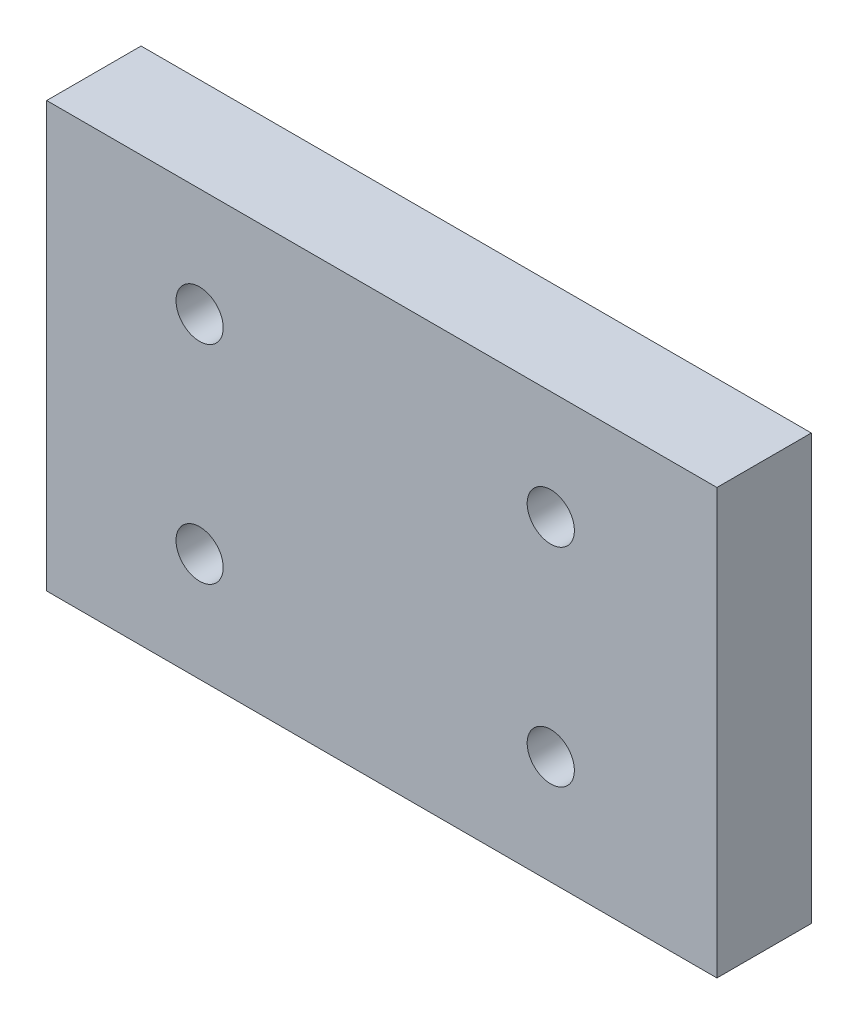
ISO-10303-21;
HEADER;
FILE_DESCRIPTION(('STEP AP214'),'2;1');
FILE_NAME('part.step','',(''),(''),'','','');
FILE_SCHEMA(('AUTOMOTIVE_DESIGN { 1 0 10303 214 1 1 1 1 }'));
ENDSEC;
DATA;
#1=APPLICATION_CONTEXT('core data for automotive mechanical design processes');
#2=APPLICATION_PROTOCOL_DEFINITION('international standard','automotive_design',2000,#1);
#3=PRODUCT_CONTEXT('',#1,'mechanical');
#4=PRODUCT('Part','Part','',(#3));
#5=PRODUCT_RELATED_PRODUCT_CATEGORY('part','',(#4));
#6=PRODUCT_DEFINITION_FORMATION('','',#4);
#7=PRODUCT_DEFINITION_CONTEXT('part definition',#1,'design');
#8=PRODUCT_DEFINITION('design','',#6,#7);
#9=PRODUCT_DEFINITION_SHAPE('','',#8);
#10=(LENGTH_UNIT() NAMED_UNIT(*) SI_UNIT(.MILLI.,.METRE.));
#11=(NAMED_UNIT(*) PLANE_ANGLE_UNIT() SI_UNIT($,.RADIAN.));
#12=(NAMED_UNIT(*) SI_UNIT($,.STERADIAN.) SOLID_ANGLE_UNIT());
#13=UNCERTAINTY_MEASURE_WITH_UNIT(LENGTH_MEASURE(1.E-05),#10,'distance_accuracy_value','');
#14=(GEOMETRIC_REPRESENTATION_CONTEXT(3) GLOBAL_UNCERTAINTY_ASSIGNED_CONTEXT((#13)) GLOBAL_UNIT_ASSIGNED_CONTEXT((#10,
#11,#12)) REPRESENTATION_CONTEXT('',''));
#15=CARTESIAN_POINT('',(0.,0.,0.));
#16=DIRECTION('',(0.,0.,1.));
#17=DIRECTION('',(1.,0.,0.));
#18=AXIS2_PLACEMENT_3D('',#15,#16,#17);
#19=CARTESIAN_POINT('',(61.,0.,10.));
#20=DIRECTION('',(1.,0.,0.));
#21=DIRECTION('',(0.,0.,-1.));
#22=AXIS2_PLACEMENT_3D('',#19,#20,#21);
#23=PLANE('',#22);
#24=DIRECTION('',(0.,-1.,0.));
#25=VECTOR('',#24,1.);
#26=CARTESIAN_POINT('',(61.,0.,0.));
#27=LINE('',#26,#25);
#28=CARTESIAN_POINT('',(61.,35.,0.));
#29=VERTEX_POINT('',#28);
#30=CARTESIAN_POINT('',(61.,-10.,0.));
#31=VERTEX_POINT('',#30);
#32=EDGE_CURVE('E121',#29,#31,#27,.T.);
#33=ORIENTED_EDGE('',*,*,#32,.F.);
#34=DIRECTION('',(0.,0.,-1.));
#35=VECTOR('',#34,1.);
#36=CARTESIAN_POINT('',(61.,35.,10.));
#37=LINE('',#36,#35);
#38=CARTESIAN_POINT('',(61.,35.,10.));
#39=VERTEX_POINT('',#38);
#40=EDGE_CURVE('E11',#39,#29,#37,.T.);
#41=ORIENTED_EDGE('',*,*,#40,.F.);
#42=DIRECTION('',(0.,-1.,0.));
#43=VECTOR('',#42,1.);
#44=CARTESIAN_POINT('',(61.,0.,10.));
#45=LINE('',#44,#43);
#46=CARTESIAN_POINT('',(61.,-10.,10.));
#47=VERTEX_POINT('',#46);
#48=EDGE_CURVE('E98',#39,#47,#45,.T.);
#49=ORIENTED_EDGE('',*,*,#48,.T.);
#50=DIRECTION('',(0.,0.,-1.));
#51=VECTOR('',#50,1.);
#52=CARTESIAN_POINT('',(61.,-10.,10.));
#53=LINE('',#52,#51);
#54=EDGE_CURVE('E59',#47,#31,#53,.T.);
#55=ORIENTED_EDGE('',*,*,#54,.T.);
#56=EDGE_LOOP('',(#33,#41,#49,#55));
#57=FACE_BOUND('',#56,.T.);
#58=ADVANCED_FACE('F41',(#57),#23,.T.);
#59=CARTESIAN_POINT('',(0.,35.,10.));
#60=DIRECTION('',(0.,-1.,0.));
#61=DIRECTION('',(0.,0.,-1.));
#62=AXIS2_PLACEMENT_3D('',#59,#60,#61);
#63=PLANE('',#62);
#64=DIRECTION('',(-1.,0.,0.));
#65=VECTOR('',#64,1.);
#66=CARTESIAN_POINT('',(0.,35.,0.));
#67=LINE('',#66,#65);
#68=CARTESIAN_POINT('',(-10.,35.,0.));
#69=VERTEX_POINT('',#68);
#70=EDGE_CURVE('E104',#29,#69,#67,.T.);
#71=ORIENTED_EDGE('',*,*,#70,.T.);
#72=DIRECTION('',(0.,0.,-1.));
#73=VECTOR('',#72,1.);
#74=CARTESIAN_POINT('',(-10.,35.,10.));
#75=LINE('',#74,#73);
#76=CARTESIAN_POINT('',(-10.,35.,10.));
#77=VERTEX_POINT('',#76);
#78=EDGE_CURVE('E51',#77,#69,#75,.T.);
#79=ORIENTED_EDGE('',*,*,#78,.F.);
#80=DIRECTION('',(-1.,0.,0.));
#81=VECTOR('',#80,1.);
#82=CARTESIAN_POINT('',(0.,35.,10.));
#83=LINE('',#82,#81);
#84=EDGE_CURVE('E94',#39,#77,#83,.T.);
#85=ORIENTED_EDGE('',*,*,#84,.F.);
#86=ORIENTED_EDGE('',*,*,#40,.T.);
#87=EDGE_LOOP('',(#71,#79,#85,#86));
#88=FACE_BOUND('',#87,.T.);
#89=ADVANCED_FACE('F102',(#88),#63,.F.);
#90=CARTESIAN_POINT('',(-10.,0.,10.));
#91=DIRECTION('',(1.,0.,0.));
#92=DIRECTION('',(0.,1.,0.));
#93=AXIS2_PLACEMENT_3D('',#90,#91,#92);
#94=PLANE('',#93);
#95=DIRECTION('',(0.,-1.,0.));
#96=VECTOR('',#95,1.);
#97=CARTESIAN_POINT('',(-10.,0.,0.));
#98=LINE('',#97,#96);
#99=CARTESIAN_POINT('',(-10.,-10.,0.));
#100=VERTEX_POINT('',#99);
#101=EDGE_CURVE('E116',#69,#100,#98,.T.);
#102=ORIENTED_EDGE('',*,*,#101,.T.);
#103=DIRECTION('',(0.,0.,-1.));
#104=VECTOR('',#103,1.);
#105=CARTESIAN_POINT('',(-10.,-10.,10.));
#106=LINE('',#105,#104);
#107=CARTESIAN_POINT('',(-10.,-10.,10.));
#108=VERTEX_POINT('',#107);
#109=EDGE_CURVE('E73',#108,#100,#106,.T.);
#110=ORIENTED_EDGE('',*,*,#109,.F.);
#111=DIRECTION('',(0.,-1.,0.));
#112=VECTOR('',#111,1.);
#113=CARTESIAN_POINT('',(-10.,0.,10.));
#114=LINE('',#113,#112);
#115=EDGE_CURVE('E85',#77,#108,#114,.T.);
#116=ORIENTED_EDGE('',*,*,#115,.F.);
#117=ORIENTED_EDGE('',*,*,#78,.T.);
#118=EDGE_LOOP('',(#102,#110,#116,#117));
#119=FACE_BOUND('',#118,.T.);
#120=ADVANCED_FACE('F87',(#119),#94,.F.);
#121=CARTESIAN_POINT('',(6.2,1.5,10.));
#122=DIRECTION('',(0.,0.,-1.));
#123=DIRECTION('',(-1.,0.,0.));
#124=AXIS2_PLACEMENT_3D('',#121,#122,#123);
#125=CYLINDRICAL_SURFACE('',#124,2.5);
#126=CARTESIAN_POINT('',(6.2,1.5,10.));
#127=DIRECTION('',(0.,0.,1.));
#128=DIRECTION('',(1.,0.,0.));
#129=AXIS2_PLACEMENT_3D('',#126,#127,#128);
#130=CIRCLE('',#129,2.5);
#131=CARTESIAN_POINT('',(8.7,1.5,10.));
#132=VERTEX_POINT('',#131);
#133=EDGE_CURVE('E144',#132,#132,#130,.T.);
#134=ORIENTED_EDGE('',*,*,#133,.T.);
#135=EDGE_LOOP('',(#134));
#136=FACE_BOUND('',#135,.T.);
#137=CARTESIAN_POINT('',(6.2,1.5,0.));
#138=DIRECTION('',(0.,0.,1.));
#139=DIRECTION('',(1.,0.,0.));
#140=AXIS2_PLACEMENT_3D('',#137,#138,#139);
#141=CIRCLE('',#140,2.5);
#142=CARTESIAN_POINT('',(8.7,1.5,0.));
#143=VERTEX_POINT('',#142);
#144=EDGE_CURVE('E124',#143,#143,#141,.T.);
#145=ORIENTED_EDGE('',*,*,#144,.F.);
#146=EDGE_LOOP('',(#145));
#147=FACE_BOUND('',#146,.T.);
#148=ADVANCED_FACE('F173',(#136,#147),#125,.F.);
#149=CARTESIAN_POINT('',(43.4,1.5,10.));
#150=DIRECTION('',(0.,0.,-1.));
#151=DIRECTION('',(-1.,0.,0.));
#152=AXIS2_PLACEMENT_3D('',#149,#150,#151);
#153=CYLINDRICAL_SURFACE('',#152,2.5);
#154=CARTESIAN_POINT('',(43.4,1.5,10.));
#155=DIRECTION('',(0.,0.,1.));
#156=DIRECTION('',(1.,0.,0.));
#157=AXIS2_PLACEMENT_3D('',#154,#155,#156);
#158=CIRCLE('',#157,2.5);
#159=CARTESIAN_POINT('',(45.9,1.5,10.));
#160=VERTEX_POINT('',#159);
#161=EDGE_CURVE('E148',#160,#160,#158,.T.);
#162=ORIENTED_EDGE('',*,*,#161,.T.);
#163=EDGE_LOOP('',(#162));
#164=FACE_BOUND('',#163,.T.);
#165=CARTESIAN_POINT('',(43.4,1.5,0.));
#166=DIRECTION('',(0.,0.,1.));
#167=DIRECTION('',(1.,0.,0.));
#168=AXIS2_PLACEMENT_3D('',#165,#166,#167);
#169=CIRCLE('',#168,2.5);
#170=CARTESIAN_POINT('',(45.9,1.5,0.));
#171=VERTEX_POINT('',#170);
#172=EDGE_CURVE('E128',#171,#171,#169,.T.);
#173=ORIENTED_EDGE('',*,*,#172,.F.);
#174=EDGE_LOOP('',(#173));
#175=FACE_BOUND('',#174,.T.);
#176=ADVANCED_FACE('F176',(#164,#175),#153,.F.);
#177=CARTESIAN_POINT('',(43.4,23.5,10.));
#178=DIRECTION('',(0.,0.,-1.));
#179=DIRECTION('',(-1.,0.,0.));
#180=AXIS2_PLACEMENT_3D('',#177,#178,#179);
#181=CYLINDRICAL_SURFACE('',#180,2.5);
#182=CARTESIAN_POINT('',(43.4,23.5,10.));
#183=DIRECTION('',(0.,0.,1.));
#184=DIRECTION('',(1.,0.,0.));
#185=AXIS2_PLACEMENT_3D('',#182,#183,#184);
#186=CIRCLE('',#185,2.5);
#187=CARTESIAN_POINT('',(45.9,23.5,10.));
#188=VERTEX_POINT('',#187);
#189=EDGE_CURVE('E152',#188,#188,#186,.T.);
#190=ORIENTED_EDGE('',*,*,#189,.T.);
#191=EDGE_LOOP('',(#190));
#192=FACE_BOUND('',#191,.T.);
#193=CARTESIAN_POINT('',(43.4,23.5,0.));
#194=DIRECTION('',(0.,0.,1.));
#195=DIRECTION('',(1.,0.,0.));
#196=AXIS2_PLACEMENT_3D('',#193,#194,#195);
#197=CIRCLE('',#196,2.5);
#198=CARTESIAN_POINT('',(45.9,23.5,0.));
#199=VERTEX_POINT('',#198);
#200=EDGE_CURVE('E132',#199,#199,#197,.T.);
#201=ORIENTED_EDGE('',*,*,#200,.F.);
#202=EDGE_LOOP('',(#201));
#203=FACE_BOUND('',#202,.T.);
#204=ADVANCED_FACE('F189',(#192,#203),#181,.F.);
#205=CARTESIAN_POINT('',(6.2,23.5,10.));
#206=DIRECTION('',(0.,0.,-1.));
#207=DIRECTION('',(-1.,0.,0.));
#208=AXIS2_PLACEMENT_3D('',#205,#206,#207);
#209=CYLINDRICAL_SURFACE('',#208,2.5);
#210=CARTESIAN_POINT('',(6.2,23.5,10.));
#211=DIRECTION('',(0.,0.,1.));
#212=DIRECTION('',(1.,0.,0.));
#213=AXIS2_PLACEMENT_3D('',#210,#211,#212);
#214=CIRCLE('',#213,2.5);
#215=CARTESIAN_POINT('',(8.7,23.5,10.));
#216=VERTEX_POINT('',#215);
#217=EDGE_CURVE('E115',#216,#216,#214,.T.);
#218=ORIENTED_EDGE('',*,*,#217,.T.);
#219=EDGE_LOOP('',(#218));
#220=FACE_BOUND('',#219,.T.);
#221=CARTESIAN_POINT('',(6.2,23.5,0.));
#222=DIRECTION('',(0.,0.,1.));
#223=DIRECTION('',(1.,0.,0.));
#224=AXIS2_PLACEMENT_3D('',#221,#222,#223);
#225=CIRCLE('',#224,2.5);
#226=CARTESIAN_POINT('',(8.7,23.5,0.));
#227=VERTEX_POINT('',#226);
#228=EDGE_CURVE('E136',#227,#227,#225,.T.);
#229=ORIENTED_EDGE('',*,*,#228,.F.);
#230=EDGE_LOOP('',(#229));
#231=FACE_BOUND('',#230,.T.);
#232=ADVANCED_FACE('F43',(#220,#231),#209,.F.);
#233=CARTESIAN_POINT('',(0.,-10.,10.));
#234=DIRECTION('',(0.,-1.,0.));
#235=DIRECTION('',(1.,0.,0.));
#236=AXIS2_PLACEMENT_3D('',#233,#234,#235);
#237=PLANE('',#236);
#238=DIRECTION('',(-1.,0.,0.));
#239=VECTOR('',#238,1.);
#240=CARTESIAN_POINT('',(0.,-10.,0.));
#241=LINE('',#240,#239);
#242=EDGE_CURVE('E111',#31,#100,#241,.T.);
#243=ORIENTED_EDGE('',*,*,#242,.F.);
#244=ORIENTED_EDGE('',*,*,#54,.F.);
#245=DIRECTION('',(-1.,0.,0.));
#246=VECTOR('',#245,1.);
#247=CARTESIAN_POINT('',(0.,-10.,10.));
#248=LINE('',#247,#246);
#249=EDGE_CURVE('E93',#47,#108,#248,.T.);
#250=ORIENTED_EDGE('',*,*,#249,.T.);
#251=ORIENTED_EDGE('',*,*,#109,.T.);
#252=EDGE_LOOP('',(#243,#244,#250,#251));
#253=FACE_BOUND('',#252,.T.);
#254=ADVANCED_FACE('F165',(#253),#237,.T.);
#255=CARTESIAN_POINT('',(0.,0.,10.));
#256=DIRECTION('',(0.,0.,1.));
#257=DIRECTION('',(1.,0.,0.));
#258=AXIS2_PLACEMENT_3D('',#255,#256,#257);
#259=PLANE('',#258);
#260=ORIENTED_EDGE('',*,*,#217,.F.);
#261=EDGE_LOOP('',(#260));
#262=FACE_BOUND('',#261,.T.);
#263=ORIENTED_EDGE('',*,*,#189,.F.);
#264=EDGE_LOOP('',(#263));
#265=FACE_BOUND('',#264,.T.);
#266=ORIENTED_EDGE('',*,*,#161,.F.);
#267=EDGE_LOOP('',(#266));
#268=FACE_BOUND('',#267,.T.);
#269=ORIENTED_EDGE('',*,*,#133,.F.);
#270=EDGE_LOOP('',(#269));
#271=FACE_BOUND('',#270,.T.);
#272=ORIENTED_EDGE('',*,*,#48,.F.);
#273=ORIENTED_EDGE('',*,*,#84,.T.);
#274=ORIENTED_EDGE('',*,*,#115,.T.);
#275=ORIENTED_EDGE('',*,*,#249,.F.);
#276=EDGE_LOOP('',(#272,#273,#274,#275));
#277=FACE_BOUND('',#276,.T.);
#278=ADVANCED_FACE('F97',(#262,#265,#268,#271,#277),#259,.T.);
#279=CARTESIAN_POINT('',(0.,0.,0.));
#280=DIRECTION('',(0.,0.,1.));
#281=DIRECTION('',(1.,0.,0.));
#282=AXIS2_PLACEMENT_3D('',#279,#280,#281);
#283=PLANE('',#282);
#284=ORIENTED_EDGE('',*,*,#228,.T.);
#285=EDGE_LOOP('',(#284));
#286=FACE_BOUND('',#285,.T.);
#287=ORIENTED_EDGE('',*,*,#200,.T.);
#288=EDGE_LOOP('',(#287));
#289=FACE_BOUND('',#288,.T.);
#290=ORIENTED_EDGE('',*,*,#172,.T.);
#291=EDGE_LOOP('',(#290));
#292=FACE_BOUND('',#291,.T.);
#293=ORIENTED_EDGE('',*,*,#144,.T.);
#294=EDGE_LOOP('',(#293));
#295=FACE_BOUND('',#294,.T.);
#296=ORIENTED_EDGE('',*,*,#32,.T.);
#297=ORIENTED_EDGE('',*,*,#242,.T.);
#298=ORIENTED_EDGE('',*,*,#101,.F.);
#299=ORIENTED_EDGE('',*,*,#70,.F.);
#300=EDGE_LOOP('',(#296,#297,#298,#299));
#301=FACE_BOUND('',#300,.T.);
#302=ADVANCED_FACE('F164',(#286,#289,#292,#295,#301),#283,.F.);
#303=CLOSED_SHELL('',(#58,#89,#120,#148,#176,#204,#232,#254,#278,#302));
#304=MANIFOLD_SOLID_BREP('B2',#303);
#305=ADVANCED_BREP_SHAPE_REPRESENTATION('',(#18,#304),#14);
#306=SHAPE_DEFINITION_REPRESENTATION(#9,#305);
ENDSEC;
END-ISO-10303-21;
